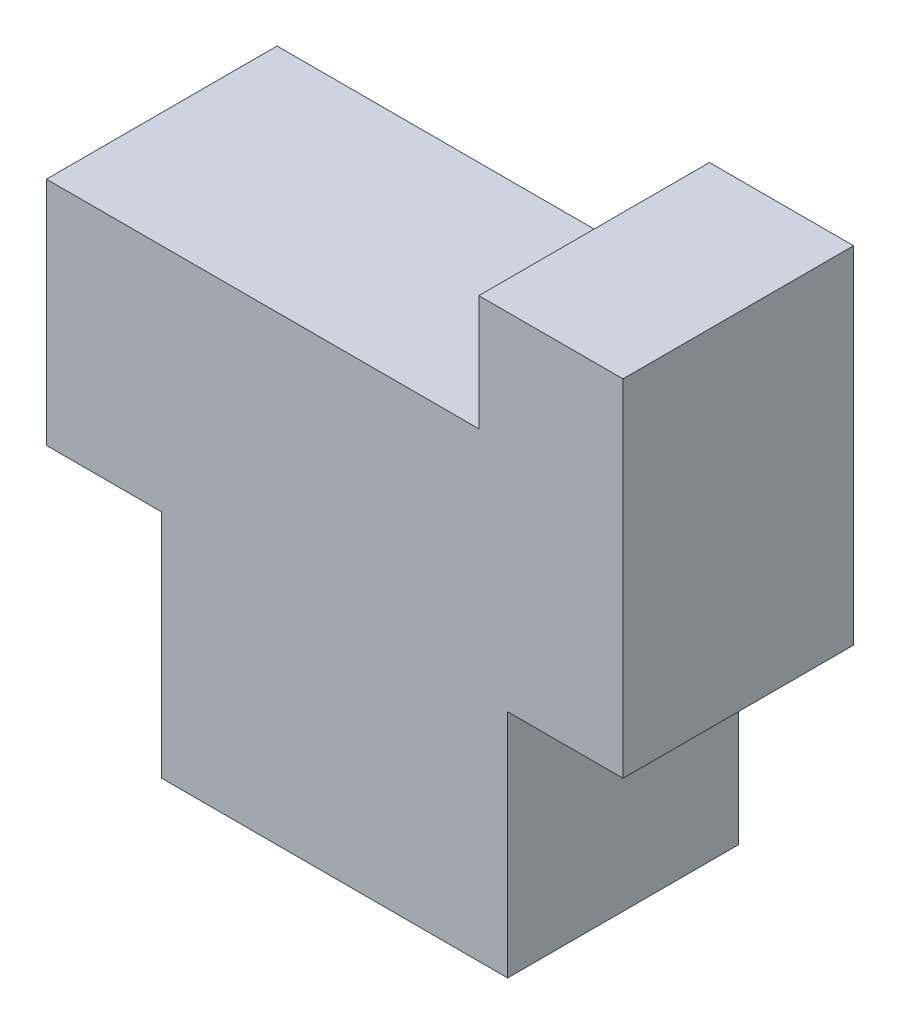
ISO-10303-21;
HEADER;
FILE_DESCRIPTION(('STEP AP214'),'2;1');
FILE_NAME('part.step','',(''),(''),'','','');
FILE_SCHEMA(('AUTOMOTIVE_DESIGN { 1 0 10303 214 1 1 1 1 }'));
ENDSEC;
DATA;
#1=APPLICATION_CONTEXT('core data for automotive mechanical design processes');
#2=APPLICATION_PROTOCOL_DEFINITION('international standard','automotive_design',2000,#1);
#3=PRODUCT_CONTEXT('',#1,'mechanical');
#4=PRODUCT('Part','Part','',(#3));
#5=PRODUCT_RELATED_PRODUCT_CATEGORY('part','',(#4));
#6=PRODUCT_DEFINITION_FORMATION('','',#4);
#7=PRODUCT_DEFINITION_CONTEXT('part definition',#1,'design');
#8=PRODUCT_DEFINITION('design','',#6,#7);
#9=PRODUCT_DEFINITION_SHAPE('','',#8);
#10=(LENGTH_UNIT() NAMED_UNIT(*) SI_UNIT(.MILLI.,.METRE.));
#11=(NAMED_UNIT(*) PLANE_ANGLE_UNIT() SI_UNIT($,.RADIAN.));
#12=(NAMED_UNIT(*) SI_UNIT($,.STERADIAN.) SOLID_ANGLE_UNIT());
#13=UNCERTAINTY_MEASURE_WITH_UNIT(LENGTH_MEASURE(1.E-05),#10,'distance_accuracy_value','');
#14=(GEOMETRIC_REPRESENTATION_CONTEXT(3) GLOBAL_UNCERTAINTY_ASSIGNED_CONTEXT((#13)) GLOBAL_UNIT_ASSIGNED_CONTEXT((#10,
#11,#12)) REPRESENTATION_CONTEXT('',''));
#15=CARTESIAN_POINT('',(0.,0.,0.));
#16=DIRECTION('',(0.,0.,1.));
#17=DIRECTION('',(1.,0.,0.));
#18=AXIS2_PLACEMENT_3D('',#15,#16,#17);
#19=CARTESIAN_POINT('',(0.,0.,4.));
#20=DIRECTION('',(1.,0.,0.));
#21=DIRECTION('',(0.,0.,-1.));
#22=AXIS2_PLACEMENT_3D('',#19,#20,#21);
#23=PLANE('',#22);
#24=DIRECTION('',(0.,-1.,0.));
#25=VECTOR('',#24,1.);
#26=CARTESIAN_POINT('',(0.,0.,0.));
#27=LINE('',#26,#25);
#28=CARTESIAN_POINT('',(0.,4.,0.));
#29=VERTEX_POINT('',#28);
#30=CARTESIAN_POINT('',(0.,0.,0.));
#31=VERTEX_POINT('',#30);
#32=EDGE_CURVE('E140',#29,#31,#27,.T.);
#33=ORIENTED_EDGE('',*,*,#32,.T.);
#34=DIRECTION('',(0.,0.,-1.));
#35=VECTOR('',#34,1.);
#36=CARTESIAN_POINT('',(0.,0.,4.));
#37=LINE('',#36,#35);
#38=CARTESIAN_POINT('',(0.,0.,4.));
#39=VERTEX_POINT('',#38);
#40=EDGE_CURVE('E11',#39,#31,#37,.T.);
#41=ORIENTED_EDGE('',*,*,#40,.F.);
#42=DIRECTION('',(0.,-1.,0.));
#43=VECTOR('',#42,1.);
#44=CARTESIAN_POINT('',(0.,0.,4.));
#45=LINE('',#44,#43);
#46=CARTESIAN_POINT('',(0.,4.,4.));
#47=VERTEX_POINT('',#46);
#48=EDGE_CURVE('E158',#47,#39,#45,.T.);
#49=ORIENTED_EDGE('',*,*,#48,.F.);
#50=DIRECTION('',(0.,0.,-1.));
#51=VECTOR('',#50,1.);
#52=CARTESIAN_POINT('',(0.,4.,4.));
#53=LINE('',#52,#51);
#54=EDGE_CURVE('E136',#47,#29,#53,.T.);
#55=ORIENTED_EDGE('',*,*,#54,.T.);
#56=EDGE_LOOP('',(#33,#41,#49,#55));
#57=FACE_BOUND('',#56,.T.);
#58=ADVANCED_FACE('F32',(#57),#23,.F.);
#59=CARTESIAN_POINT('',(0.,0.,4.));
#60=DIRECTION('',(0.,1.,0.));
#61=DIRECTION('',(0.,0.,1.));
#62=AXIS2_PLACEMENT_3D('',#59,#60,#61);
#63=PLANE('',#62);
#64=DIRECTION('',(1.,0.,0.));
#65=VECTOR('',#64,1.);
#66=CARTESIAN_POINT('',(0.,0.,0.));
#67=LINE('',#66,#65);
#68=CARTESIAN_POINT('',(6.,0.,0.));
#69=VERTEX_POINT('',#68);
#70=EDGE_CURVE('E143',#31,#69,#67,.T.);
#71=ORIENTED_EDGE('',*,*,#70,.T.);
#72=DIRECTION('',(0.,0.,-1.));
#73=VECTOR('',#72,1.);
#74=CARTESIAN_POINT('',(6.,0.,4.));
#75=LINE('',#74,#73);
#76=CARTESIAN_POINT('',(6.,0.,4.));
#77=VERTEX_POINT('',#76);
#78=EDGE_CURVE('E40',#77,#69,#75,.T.);
#79=ORIENTED_EDGE('',*,*,#78,.F.);
#80=DIRECTION('',(1.,0.,0.));
#81=VECTOR('',#80,1.);
#82=CARTESIAN_POINT('',(0.,0.,4.));
#83=LINE('',#82,#81);
#84=EDGE_CURVE('E97',#39,#77,#83,.T.);
#85=ORIENTED_EDGE('',*,*,#84,.F.);
#86=ORIENTED_EDGE('',*,*,#40,.T.);
#87=EDGE_LOOP('',(#71,#79,#85,#86));
#88=FACE_BOUND('',#87,.T.);
#89=ADVANCED_FACE('F207',(#88),#63,.F.);
#90=CARTESIAN_POINT('',(6.,0.,4.));
#91=DIRECTION('',(-1.,0.,0.));
#92=DIRECTION('',(0.,0.,1.));
#93=AXIS2_PLACEMENT_3D('',#90,#91,#92);
#94=PLANE('',#93);
#95=DIRECTION('',(0.,1.,0.));
#96=VECTOR('',#95,1.);
#97=CARTESIAN_POINT('',(6.,0.,0.));
#98=LINE('',#97,#96);
#99=CARTESIAN_POINT('',(6.,4.,0.));
#100=VERTEX_POINT('',#99);
#101=EDGE_CURVE('E145',#69,#100,#98,.T.);
#102=ORIENTED_EDGE('',*,*,#101,.T.);
#103=DIRECTION('',(0.,0.,-1.));
#104=VECTOR('',#103,1.);
#105=CARTESIAN_POINT('',(6.,4.,4.));
#106=LINE('',#105,#104);
#107=CARTESIAN_POINT('',(6.,4.,4.));
#108=VERTEX_POINT('',#107);
#109=EDGE_CURVE('E171',#108,#100,#106,.T.);
#110=ORIENTED_EDGE('',*,*,#109,.F.);
#111=DIRECTION('',(0.,1.,0.));
#112=VECTOR('',#111,1.);
#113=CARTESIAN_POINT('',(6.,0.,4.));
#114=LINE('',#113,#112);
#115=EDGE_CURVE('E179',#77,#108,#114,.T.);
#116=ORIENTED_EDGE('',*,*,#115,.F.);
#117=ORIENTED_EDGE('',*,*,#78,.T.);
#118=EDGE_LOOP('',(#102,#110,#116,#117));
#119=FACE_BOUND('',#118,.T.);
#120=ADVANCED_FACE('F177',(#119),#94,.F.);
#121=CARTESIAN_POINT('',(6.,4.,4.));
#122=DIRECTION('',(0.,1.,0.));
#123=DIRECTION('',(0.,0.,1.));
#124=AXIS2_PLACEMENT_3D('',#121,#122,#123);
#125=PLANE('',#124);
#126=DIRECTION('',(1.,0.,0.));
#127=VECTOR('',#126,1.);
#128=CARTESIAN_POINT('',(6.,4.,0.));
#129=LINE('',#128,#127);
#130=CARTESIAN_POINT('',(8.,4.,0.));
#131=VERTEX_POINT('',#130);
#132=EDGE_CURVE('E147',#100,#131,#129,.T.);
#133=ORIENTED_EDGE('',*,*,#132,.T.);
#134=DIRECTION('',(0.,0.,-1.));
#135=VECTOR('',#134,1.);
#136=CARTESIAN_POINT('',(8.,4.,4.));
#137=LINE('',#136,#135);
#138=CARTESIAN_POINT('',(8.,4.,4.));
#139=VERTEX_POINT('',#138);
#140=EDGE_CURVE('E168',#139,#131,#137,.T.);
#141=ORIENTED_EDGE('',*,*,#140,.F.);
#142=DIRECTION('',(1.,0.,0.));
#143=VECTOR('',#142,1.);
#144=CARTESIAN_POINT('',(6.,4.,4.));
#145=LINE('',#144,#143);
#146=EDGE_CURVE('E197',#108,#139,#145,.T.);
#147=ORIENTED_EDGE('',*,*,#146,.F.);
#148=ORIENTED_EDGE('',*,*,#109,.T.);
#149=EDGE_LOOP('',(#133,#141,#147,#148));
#150=FACE_BOUND('',#149,.T.);
#151=ADVANCED_FACE('F188',(#150),#125,.F.);
#152=CARTESIAN_POINT('',(8.,10.,4.));
#153=DIRECTION('',(-1.,0.,0.));
#154=DIRECTION('',(0.,-1.,0.));
#155=AXIS2_PLACEMENT_3D('',#152,#153,#154);
#156=PLANE('',#155);
#157=DIRECTION('',(0.,1.,0.));
#158=VECTOR('',#157,1.);
#159=CARTESIAN_POINT('',(8.,10.,0.));
#160=LINE('',#159,#158);
#161=CARTESIAN_POINT('',(8.,10.,0.));
#162=VERTEX_POINT('',#161);
#163=EDGE_CURVE('E149',#131,#162,#160,.T.);
#164=ORIENTED_EDGE('',*,*,#163,.T.);
#165=DIRECTION('',(0.,0.,-1.));
#166=VECTOR('',#165,1.);
#167=CARTESIAN_POINT('',(8.,10.,4.));
#168=LINE('',#167,#166);
#169=CARTESIAN_POINT('',(8.,10.,4.));
#170=VERTEX_POINT('',#169);
#171=EDGE_CURVE('E165',#170,#162,#168,.T.);
#172=ORIENTED_EDGE('',*,*,#171,.F.);
#173=DIRECTION('',(0.,1.,0.));
#174=VECTOR('',#173,1.);
#175=CARTESIAN_POINT('',(8.,10.,4.));
#176=LINE('',#175,#174);
#177=EDGE_CURVE('E194',#139,#170,#176,.T.);
#178=ORIENTED_EDGE('',*,*,#177,.F.);
#179=ORIENTED_EDGE('',*,*,#140,.T.);
#180=EDGE_LOOP('',(#164,#172,#178,#179));
#181=FACE_BOUND('',#180,.T.);
#182=ADVANCED_FACE('F192',(#181),#156,.F.);
#183=CARTESIAN_POINT('',(5.5,10.,4.));
#184=DIRECTION('',(0.,-1.,0.));
#185=DIRECTION('',(0.,0.,-1.));
#186=AXIS2_PLACEMENT_3D('',#183,#184,#185);
#187=PLANE('',#186);
#188=DIRECTION('',(-1.,0.,0.));
#189=VECTOR('',#188,1.);
#190=CARTESIAN_POINT('',(5.5,10.,0.));
#191=LINE('',#190,#189);
#192=CARTESIAN_POINT('',(5.5,10.,0.));
#193=VERTEX_POINT('',#192);
#194=EDGE_CURVE('E151',#162,#193,#191,.T.);
#195=ORIENTED_EDGE('',*,*,#194,.T.);
#196=DIRECTION('',(0.,0.,-1.));
#197=VECTOR('',#196,1.);
#198=CARTESIAN_POINT('',(5.5,10.,4.));
#199=LINE('',#198,#197);
#200=CARTESIAN_POINT('',(5.5,10.,4.));
#201=VERTEX_POINT('',#200);
#202=EDGE_CURVE('E162',#201,#193,#199,.T.);
#203=ORIENTED_EDGE('',*,*,#202,.F.);
#204=DIRECTION('',(-1.,0.,0.));
#205=VECTOR('',#204,1.);
#206=CARTESIAN_POINT('',(5.5,10.,4.));
#207=LINE('',#206,#205);
#208=EDGE_CURVE('E196',#170,#201,#207,.T.);
#209=ORIENTED_EDGE('',*,*,#208,.F.);
#210=ORIENTED_EDGE('',*,*,#171,.T.);
#211=EDGE_LOOP('',(#195,#203,#209,#210));
#212=FACE_BOUND('',#211,.T.);
#213=ADVANCED_FACE('F219',(#212),#187,.F.);
#214=CARTESIAN_POINT('',(5.5,8.,4.));
#215=DIRECTION('',(1.,0.,0.));
#216=DIRECTION('',(0.,0.,-1.));
#217=AXIS2_PLACEMENT_3D('',#214,#215,#216);
#218=PLANE('',#217);
#219=DIRECTION('',(0.,-1.,0.));
#220=VECTOR('',#219,1.);
#221=CARTESIAN_POINT('',(5.5,8.,0.));
#222=LINE('',#221,#220);
#223=CARTESIAN_POINT('',(5.5,8.,0.));
#224=VERTEX_POINT('',#223);
#225=EDGE_CURVE('E153',#193,#224,#222,.T.);
#226=ORIENTED_EDGE('',*,*,#225,.T.);
#227=DIRECTION('',(0.,0.,-1.));
#228=VECTOR('',#227,1.);
#229=CARTESIAN_POINT('',(5.5,8.,4.));
#230=LINE('',#229,#228);
#231=CARTESIAN_POINT('',(5.5,8.,4.));
#232=VERTEX_POINT('',#231);
#233=EDGE_CURVE('E131',#232,#224,#230,.T.);
#234=ORIENTED_EDGE('',*,*,#233,.F.);
#235=DIRECTION('',(0.,-1.,0.));
#236=VECTOR('',#235,1.);
#237=CARTESIAN_POINT('',(5.5,8.,4.));
#238=LINE('',#237,#236);
#239=EDGE_CURVE('E122',#201,#232,#238,.T.);
#240=ORIENTED_EDGE('',*,*,#239,.F.);
#241=ORIENTED_EDGE('',*,*,#202,.T.);
#242=EDGE_LOOP('',(#226,#234,#240,#241));
#243=FACE_BOUND('',#242,.T.);
#244=ADVANCED_FACE('F222',(#243),#218,.F.);
#245=CARTESIAN_POINT('',(-2.,8.,4.));
#246=DIRECTION('',(0.,-1.,0.));
#247=DIRECTION('',(0.,0.,-1.));
#248=AXIS2_PLACEMENT_3D('',#245,#246,#247);
#249=PLANE('',#248);
#250=DIRECTION('',(-1.,0.,0.));
#251=VECTOR('',#250,1.);
#252=CARTESIAN_POINT('',(-2.,8.,0.));
#253=LINE('',#252,#251);
#254=CARTESIAN_POINT('',(-2.,8.,0.));
#255=VERTEX_POINT('',#254);
#256=EDGE_CURVE('E130',#224,#255,#253,.T.);
#257=ORIENTED_EDGE('',*,*,#256,.T.);
#258=DIRECTION('',(0.,0.,-1.));
#259=VECTOR('',#258,1.);
#260=CARTESIAN_POINT('',(-2.,8.,4.));
#261=LINE('',#260,#259);
#262=CARTESIAN_POINT('',(-2.,8.,4.));
#263=VERTEX_POINT('',#262);
#264=EDGE_CURVE('E127',#263,#255,#261,.T.);
#265=ORIENTED_EDGE('',*,*,#264,.F.);
#266=DIRECTION('',(-1.,0.,0.));
#267=VECTOR('',#266,1.);
#268=CARTESIAN_POINT('',(-2.,8.,4.));
#269=LINE('',#268,#267);
#270=EDGE_CURVE('E116',#232,#263,#269,.T.);
#271=ORIENTED_EDGE('',*,*,#270,.F.);
#272=ORIENTED_EDGE('',*,*,#233,.T.);
#273=EDGE_LOOP('',(#257,#265,#271,#272));
#274=FACE_BOUND('',#273,.T.);
#275=ADVANCED_FACE('F128',(#274),#249,.F.);
#276=CARTESIAN_POINT('',(-2.,4.,4.));
#277=DIRECTION('',(1.,0.,0.));
#278=DIRECTION('',(0.,0.,-1.));
#279=AXIS2_PLACEMENT_3D('',#276,#277,#278);
#280=PLANE('',#279);
#281=DIRECTION('',(0.,-1.,0.));
#282=VECTOR('',#281,1.);
#283=CARTESIAN_POINT('',(-2.,4.,0.));
#284=LINE('',#283,#282);
#285=CARTESIAN_POINT('',(-2.,4.,0.));
#286=VERTEX_POINT('',#285);
#287=EDGE_CURVE('E83',#255,#286,#284,.T.);
#288=ORIENTED_EDGE('',*,*,#287,.T.);
#289=DIRECTION('',(0.,0.,-1.));
#290=VECTOR('',#289,1.);
#291=CARTESIAN_POINT('',(-2.,4.,4.));
#292=LINE('',#291,#290);
#293=CARTESIAN_POINT('',(-2.,4.,4.));
#294=VERTEX_POINT('',#293);
#295=EDGE_CURVE('E132',#294,#286,#292,.T.);
#296=ORIENTED_EDGE('',*,*,#295,.F.);
#297=DIRECTION('',(0.,-1.,0.));
#298=VECTOR('',#297,1.);
#299=CARTESIAN_POINT('',(-2.,4.,4.));
#300=LINE('',#299,#298);
#301=EDGE_CURVE('E120',#263,#294,#300,.T.);
#302=ORIENTED_EDGE('',*,*,#301,.F.);
#303=ORIENTED_EDGE('',*,*,#264,.T.);
#304=EDGE_LOOP('',(#288,#296,#302,#303));
#305=FACE_BOUND('',#304,.T.);
#306=ADVANCED_FACE('F134',(#305),#280,.F.);
#307=CARTESIAN_POINT('',(0.,4.,4.));
#308=DIRECTION('',(0.,1.,0.));
#309=DIRECTION('',(0.,0.,1.));
#310=AXIS2_PLACEMENT_3D('',#307,#308,#309);
#311=PLANE('',#310);
#312=DIRECTION('',(1.,0.,0.));
#313=VECTOR('',#312,1.);
#314=CARTESIAN_POINT('',(0.,4.,0.));
#315=LINE('',#314,#313);
#316=EDGE_CURVE('E89',#286,#29,#315,.T.);
#317=ORIENTED_EDGE('',*,*,#316,.T.);
#318=ORIENTED_EDGE('',*,*,#54,.F.);
#319=DIRECTION('',(1.,0.,0.));
#320=VECTOR('',#319,1.);
#321=CARTESIAN_POINT('',(0.,4.,4.));
#322=LINE('',#321,#320);
#323=EDGE_CURVE('E48',#294,#47,#322,.T.);
#324=ORIENTED_EDGE('',*,*,#323,.F.);
#325=ORIENTED_EDGE('',*,*,#295,.T.);
#326=EDGE_LOOP('',(#317,#318,#324,#325));
#327=FACE_BOUND('',#326,.T.);
#328=ADVANCED_FACE('F231',(#327),#311,.F.);
#329=CARTESIAN_POINT('',(0.,0.,4.));
#330=DIRECTION('',(0.,0.,1.));
#331=DIRECTION('',(1.,0.,0.));
#332=AXIS2_PLACEMENT_3D('',#329,#330,#331);
#333=PLANE('',#332);
#334=ORIENTED_EDGE('',*,*,#48,.T.);
#335=ORIENTED_EDGE('',*,*,#84,.T.);
#336=ORIENTED_EDGE('',*,*,#115,.T.);
#337=ORIENTED_EDGE('',*,*,#146,.T.);
#338=ORIENTED_EDGE('',*,*,#177,.T.);
#339=ORIENTED_EDGE('',*,*,#208,.T.);
#340=ORIENTED_EDGE('',*,*,#239,.T.);
#341=ORIENTED_EDGE('',*,*,#270,.T.);
#342=ORIENTED_EDGE('',*,*,#301,.T.);
#343=ORIENTED_EDGE('',*,*,#323,.T.);
#344=EDGE_LOOP('',(#334,#335,#336,#337,#338,#339,#340,#341,#342,#343));
#345=FACE_BOUND('',#344,.T.);
#346=ADVANCED_FACE('F118',(#345),#333,.T.);
#347=CARTESIAN_POINT('',(0.,0.,0.));
#348=DIRECTION('',(0.,0.,1.));
#349=DIRECTION('',(1.,0.,0.));
#350=AXIS2_PLACEMENT_3D('',#347,#348,#349);
#351=PLANE('',#350);
#352=ORIENTED_EDGE('',*,*,#32,.F.);
#353=ORIENTED_EDGE('',*,*,#316,.F.);
#354=ORIENTED_EDGE('',*,*,#287,.F.);
#355=ORIENTED_EDGE('',*,*,#256,.F.);
#356=ORIENTED_EDGE('',*,*,#225,.F.);
#357=ORIENTED_EDGE('',*,*,#194,.F.);
#358=ORIENTED_EDGE('',*,*,#163,.F.);
#359=ORIENTED_EDGE('',*,*,#132,.F.);
#360=ORIENTED_EDGE('',*,*,#101,.F.);
#361=ORIENTED_EDGE('',*,*,#70,.F.);
#362=EDGE_LOOP('',(#352,#353,#354,#355,#356,#357,#358,#359,#360,#361));
#363=FACE_BOUND('',#362,.T.);
#364=ADVANCED_FACE('F183',(#363),#351,.F.);
#365=CLOSED_SHELL('',(#58,#89,#120,#151,#182,#213,#244,#275,#306,#328,#346,#364));
#366=MANIFOLD_SOLID_BREP('B2',#365);
#367=ADVANCED_BREP_SHAPE_REPRESENTATION('',(#18,#366),#14);
#368=SHAPE_DEFINITION_REPRESENTATION(#9,#367);
ENDSEC;
END-ISO-10303-21;
